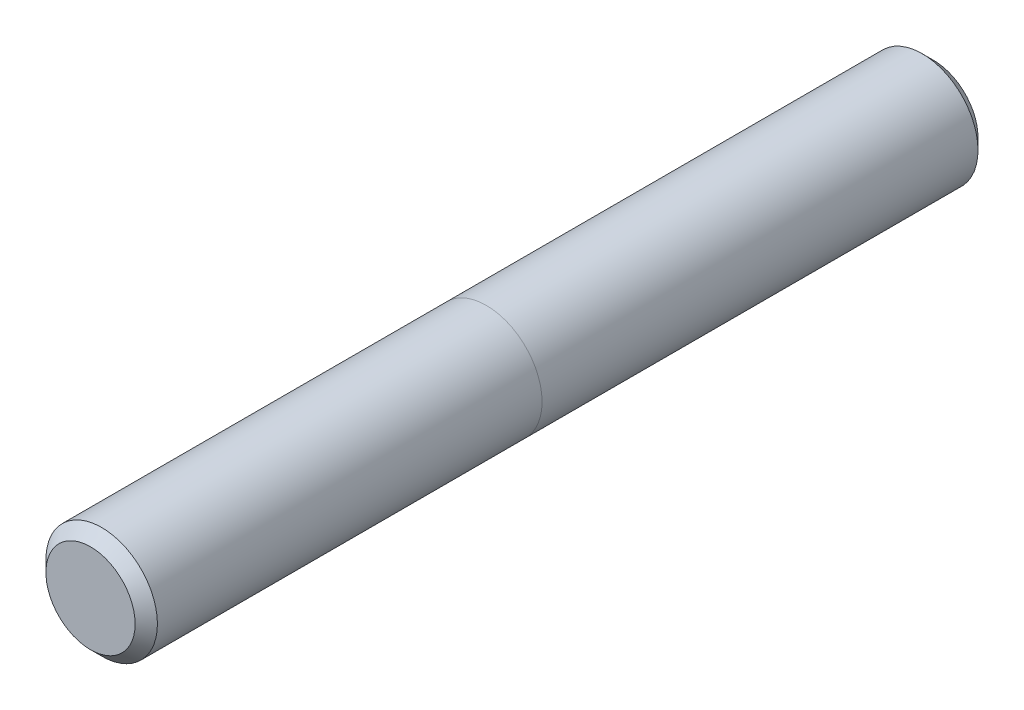
ISO-10303-21;
HEADER;
FILE_DESCRIPTION(('STEP AP214'),'2;1');
FILE_NAME('part.step','',(''),(''),'','','');
FILE_SCHEMA(('AUTOMOTIVE_DESIGN { 1 0 10303 214 1 1 1 1 }'));
ENDSEC;
DATA;
#1=APPLICATION_CONTEXT('core data for automotive mechanical design processes');
#2=APPLICATION_PROTOCOL_DEFINITION('international standard','automotive_design',2000,#1);
#3=PRODUCT_CONTEXT('',#1,'mechanical');
#4=PRODUCT('Part','Part','',(#3));
#5=PRODUCT_RELATED_PRODUCT_CATEGORY('part','',(#4));
#6=PRODUCT_DEFINITION_FORMATION('','',#4);
#7=PRODUCT_DEFINITION_CONTEXT('part definition',#1,'design');
#8=PRODUCT_DEFINITION('design','',#6,#7);
#9=PRODUCT_DEFINITION_SHAPE('','',#8);
#10=(LENGTH_UNIT() NAMED_UNIT(*) SI_UNIT(.MILLI.,.METRE.));
#11=(NAMED_UNIT(*) PLANE_ANGLE_UNIT() SI_UNIT($,.RADIAN.));
#12=(NAMED_UNIT(*) SI_UNIT($,.STERADIAN.) SOLID_ANGLE_UNIT());
#13=UNCERTAINTY_MEASURE_WITH_UNIT(LENGTH_MEASURE(1.E-05),#10,'distance_accuracy_value','');
#14=(GEOMETRIC_REPRESENTATION_CONTEXT(3) GLOBAL_UNCERTAINTY_ASSIGNED_CONTEXT((#13)) GLOBAL_UNIT_ASSIGNED_CONTEXT((#10,
#11,#12)) REPRESENTATION_CONTEXT('',''));
#15=CARTESIAN_POINT('',(0.,0.,0.));
#16=DIRECTION('',(0.,0.,1.));
#17=DIRECTION('',(1.,0.,0.));
#18=AXIS2_PLACEMENT_3D('',#15,#16,#17);
#19=CARTESIAN_POINT('',(0.,0.,60.));
#20=DIRECTION('',(0.,0.,-1.));
#21=DIRECTION('',(-1.,0.,0.));
#22=AXIS2_PLACEMENT_3D('',#19,#20,#21);
#23=CYLINDRICAL_SURFACE('',#22,7.9375);
#24=CARTESIAN_POINT('',(0.,0.,58.4125));
#25=DIRECTION('',(0.,0.,1.));
#26=DIRECTION('',(1.,0.,0.));
#27=AXIS2_PLACEMENT_3D('',#24,#25,#26);
#28=CIRCLE('',#27,7.9375);
#29=CARTESIAN_POINT('',(7.9375,0.,58.4125));
#30=VERTEX_POINT('',#29);
#31=EDGE_CURVE('E75',#30,#30,#28,.F.);
#32=ORIENTED_EDGE('',*,*,#31,.T.);
#33=EDGE_LOOP('',(#32));
#34=FACE_BOUND('',#33,.T.);
#35=CARTESIAN_POINT('',(0.,0.,3.64999999999999));
#36=DIRECTION('',(0.,0.,-1.));
#37=DIRECTION('',(-1.,0.,0.));
#38=AXIS2_PLACEMENT_3D('',#35,#36,#37);
#39=CIRCLE('',#38,7.9375);
#40=CARTESIAN_POINT('',(-7.9375,0.,3.64999999999999));
#41=VERTEX_POINT('',#40);
#42=CARTESIAN_POINT('',(7.9375,0.,3.64999999999999));
#43=VERTEX_POINT('',#42);
#44=EDGE_CURVE('E11',#41,#43,#39,.T.);
#45=ORIENTED_EDGE('',*,*,#44,.F.);
#46=EDGE_CURVE('E47',#43,#41,#39,.T.);
#47=ORIENTED_EDGE('',*,*,#46,.F.);
#48=EDGE_LOOP('',(#45,#47));
#49=FACE_BOUND('',#48,.T.);
#50=ADVANCED_FACE('F43',(#34,#49),#23,.T.);
#51=ORIENTED_EDGE('',*,*,#46,.T.);
#52=ORIENTED_EDGE('',*,*,#44,.T.);
#53=EDGE_LOOP('',(#51,#52));
#54=FACE_BOUND('',#53,.T.);
#55=CARTESIAN_POINT('',(0.,0.,-58.4125));
#56=DIRECTION('',(0.,0.,1.));
#57=DIRECTION('',(1.,0.,0.));
#58=AXIS2_PLACEMENT_3D('',#55,#56,#57);
#59=CIRCLE('',#58,7.9375);
#60=CARTESIAN_POINT('',(7.9375,0.,-58.4125));
#61=VERTEX_POINT('',#60);
#62=EDGE_CURVE('E70',#61,#61,#59,.T.);
#63=ORIENTED_EDGE('',*,*,#62,.T.);
#64=EDGE_LOOP('',(#63));
#65=FACE_BOUND('',#64,.T.);
#66=ADVANCED_FACE('F59',(#54,#65),#23,.T.);
#67=CARTESIAN_POINT('',(0.,0.,60.));
#68=DIRECTION('',(0.,0.,1.));
#69=DIRECTION('',(1.,0.,0.));
#70=AXIS2_PLACEMENT_3D('',#67,#68,#69);
#71=PLANE('',#70);
#72=CARTESIAN_POINT('',(0.,0.,60.));
#73=DIRECTION('',(0.,0.,1.));
#74=DIRECTION('',(1.,0.,0.));
#75=AXIS2_PLACEMENT_3D('',#72,#73,#74);
#76=CIRCLE('',#75,6.34999999999999);
#77=CARTESIAN_POINT('',(6.34999999999999,0.,60.));
#78=VERTEX_POINT('',#77);
#79=EDGE_CURVE('E62',#78,#78,#76,.T.);
#80=ORIENTED_EDGE('',*,*,#79,.T.);
#81=EDGE_LOOP('',(#80));
#82=FACE_BOUND('',#81,.T.);
#83=ADVANCED_FACE('F93',(#82),#71,.T.);
#84=CARTESIAN_POINT('',(0.,0.,-60.));
#85=DIRECTION('',(0.,0.,1.));
#86=DIRECTION('',(1.,0.,0.));
#87=AXIS2_PLACEMENT_3D('',#84,#85,#86);
#88=PLANE('',#87);
#89=CARTESIAN_POINT('',(0.,0.,-60.));
#90=DIRECTION('',(0.,0.,1.));
#91=DIRECTION('',(1.,0.,0.));
#92=AXIS2_PLACEMENT_3D('',#89,#90,#91);
#93=CIRCLE('',#92,6.34999999999998);
#94=CARTESIAN_POINT('',(6.34999999999998,0.,-60.));
#95=VERTEX_POINT('',#94);
#96=EDGE_CURVE('E66',#95,#95,#93,.F.);
#97=ORIENTED_EDGE('',*,*,#96,.T.);
#98=EDGE_LOOP('',(#97));
#99=FACE_BOUND('',#98,.T.);
#100=ADVANCED_FACE('F87',(#99),#88,.F.);
#101=CARTESIAN_POINT('',(0.,0.,-58.4125));
#102=DIRECTION('',(0.,0.,1.));
#103=DIRECTION('',(1.,0.,0.));
#104=AXIS2_PLACEMENT_3D('',#101,#102,#103);
#105=CONICAL_SURFACE('',#104,7.9375,0.785398163397453);
#106=ORIENTED_EDGE('',*,*,#96,.F.);
#107=EDGE_LOOP('',(#106));
#108=FACE_BOUND('',#107,.T.);
#109=ORIENTED_EDGE('',*,*,#62,.F.);
#110=EDGE_LOOP('',(#109));
#111=FACE_BOUND('',#110,.T.);
#112=ADVANCED_FACE('F82',(#108,#111),#105,.T.);
#113=CARTESIAN_POINT('',(0.,0.,60.));
#114=DIRECTION('',(0.,0.,-1.));
#115=DIRECTION('',(-1.,0.,0.));
#116=AXIS2_PLACEMENT_3D('',#113,#114,#115);
#117=CONICAL_SURFACE('',#116,6.34999999999999,0.785398163397446);
#118=ORIENTED_EDGE('',*,*,#31,.F.);
#119=EDGE_LOOP('',(#118));
#120=FACE_BOUND('',#119,.T.);
#121=ORIENTED_EDGE('',*,*,#79,.F.);
#122=EDGE_LOOP('',(#121));
#123=FACE_BOUND('',#122,.T.);
#124=ADVANCED_FACE('F45',(#120,#123),#117,.T.);
#125=CLOSED_SHELL('',(#50,#66,#83,#100,#112,#124));
#126=MANIFOLD_SOLID_BREP('B2',#125);
#127=ADVANCED_BREP_SHAPE_REPRESENTATION('',(#18,#126),#14);
#128=SHAPE_DEFINITION_REPRESENTATION(#9,#127);
ENDSEC;
END-ISO-10303-21;
